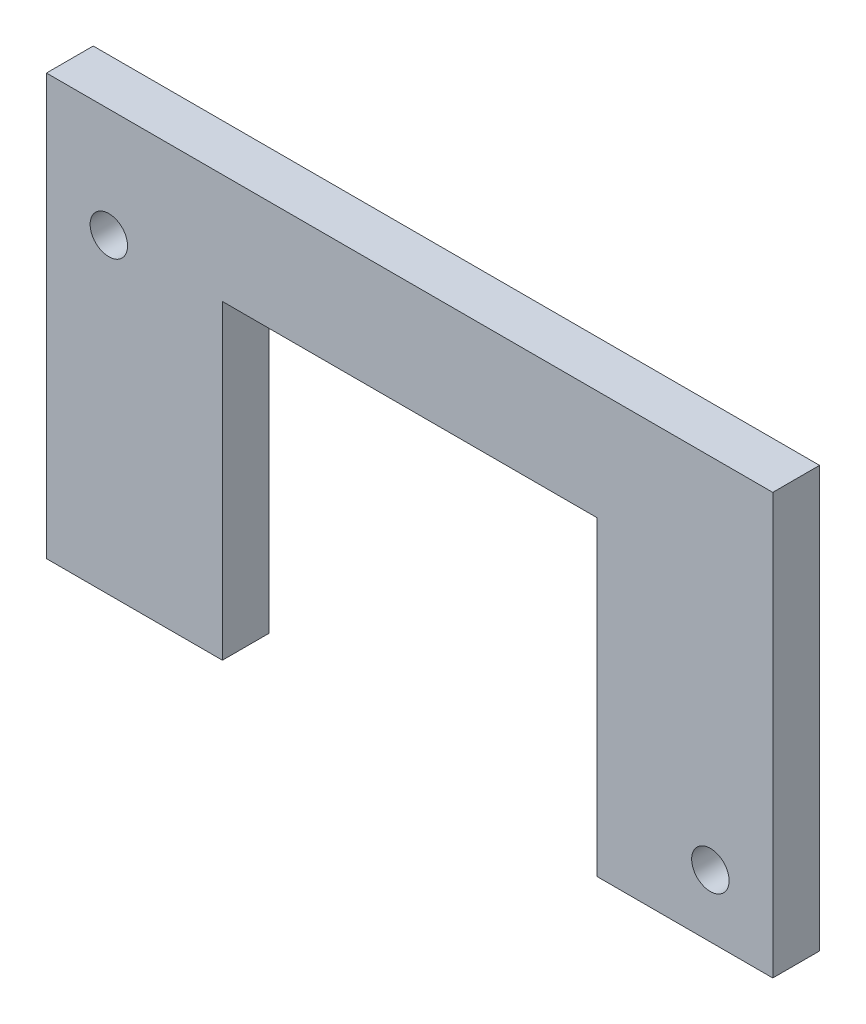
ISO-10303-21;
HEADER;
FILE_DESCRIPTION(('STEP AP214'),'2;1');
FILE_NAME('part.step','',(''),(''),'','','');
FILE_SCHEMA(('AUTOMOTIVE_DESIGN { 1 0 10303 214 1 1 1 1 }'));
ENDSEC;
DATA;
#1=APPLICATION_CONTEXT('core data for automotive mechanical design processes');
#2=APPLICATION_PROTOCOL_DEFINITION('international standard','automotive_design',2000,#1);
#3=PRODUCT_CONTEXT('',#1,'mechanical');
#4=PRODUCT('Part','Part','',(#3));
#5=PRODUCT_RELATED_PRODUCT_CATEGORY('part','',(#4));
#6=PRODUCT_DEFINITION_FORMATION('','',#4);
#7=PRODUCT_DEFINITION_CONTEXT('part definition',#1,'design');
#8=PRODUCT_DEFINITION('design','',#6,#7);
#9=PRODUCT_DEFINITION_SHAPE('','',#8);
#10=(LENGTH_UNIT() NAMED_UNIT(*) SI_UNIT(.MILLI.,.METRE.));
#11=(NAMED_UNIT(*) PLANE_ANGLE_UNIT() SI_UNIT($,.RADIAN.));
#12=(NAMED_UNIT(*) SI_UNIT($,.STERADIAN.) SOLID_ANGLE_UNIT());
#13=UNCERTAINTY_MEASURE_WITH_UNIT(LENGTH_MEASURE(1.E-05),#10,'distance_accuracy_value','');
#14=(GEOMETRIC_REPRESENTATION_CONTEXT(3) GLOBAL_UNCERTAINTY_ASSIGNED_CONTEXT((#13)) GLOBAL_UNIT_ASSIGNED_CONTEXT((#10,
#11,#12)) REPRESENTATION_CONTEXT('',''));
#15=CARTESIAN_POINT('',(0.,0.,0.));
#16=DIRECTION('',(0.,0.,1.));
#17=DIRECTION('',(1.,0.,0.));
#18=AXIS2_PLACEMENT_3D('',#15,#16,#17);
#19=CARTESIAN_POINT('',(-1.5875,-1.5875,2.38125));
#20=DIRECTION('',(0.,1.,0.));
#21=DIRECTION('',(0.,0.,1.));
#22=AXIS2_PLACEMENT_3D('',#19,#20,#21);
#23=PLANE('',#22);
#24=DIRECTION('',(1.,0.,0.));
#25=VECTOR('',#24,1.);
#26=CARTESIAN_POINT('',(-1.5875,-1.5875,0.));
#27=LINE('',#26,#25);
#28=CARTESIAN_POINT('',(-1.5875,-1.5875,0.));
#29=VERTEX_POINT('',#28);
#30=CARTESIAN_POINT('',(7.366,-1.5875,0.));
#31=VERTEX_POINT('',#30);
#32=EDGE_CURVE('E130',#29,#31,#27,.T.);
#33=ORIENTED_EDGE('',*,*,#32,.T.);
#34=DIRECTION('',(0.,0.,1.));
#35=VECTOR('',#34,1.);
#36=CARTESIAN_POINT('',(7.366,-1.5875,-0.00100000000000013));
#37=LINE('',#36,#35);
#38=CARTESIAN_POINT('',(7.366,-1.5875,2.38125));
#39=VERTEX_POINT('',#38);
#40=EDGE_CURVE('E113',#31,#39,#37,.T.);
#41=ORIENTED_EDGE('',*,*,#40,.T.);
#42=DIRECTION('',(1.,0.,0.));
#43=VECTOR('',#42,1.);
#44=CARTESIAN_POINT('',(-1.5875,-1.5875,2.38125));
#45=LINE('',#44,#43);
#46=CARTESIAN_POINT('',(-1.5875,-1.5875,2.38125));
#47=VERTEX_POINT('',#46);
#48=EDGE_CURVE('E91',#47,#39,#45,.T.);
#49=ORIENTED_EDGE('',*,*,#48,.F.);
#50=DIRECTION('',(0.,0.,-1.));
#51=VECTOR('',#50,1.);
#52=CARTESIAN_POINT('',(-1.5875,-1.5875,2.38125));
#53=LINE('',#52,#51);
#54=EDGE_CURVE('E11',#47,#29,#53,.T.);
#55=ORIENTED_EDGE('',*,*,#54,.T.);
#56=EDGE_LOOP('',(#33,#41,#49,#55));
#57=FACE_BOUND('',#56,.T.);
#58=ADVANCED_FACE('F38',(#57),#23,.F.);
#59=CARTESIAN_POINT('',(0.,0.,2.38125));
#60=DIRECTION('',(0.,0.,-1.));
#61=DIRECTION('',(-1.,0.,0.));
#62=AXIS2_PLACEMENT_3D('',#59,#60,#61);
#63=PLANE('',#62);
#64=ORIENTED_EDGE('',*,*,#48,.T.);
#65=DIRECTION('',(0.,-1.,0.));
#66=VECTOR('',#65,1.);
#67=CARTESIAN_POINT('',(7.366,-1.5875,2.38125));
#68=LINE('',#67,#66);
#69=CARTESIAN_POINT('',(7.366,14.224,2.38125));
#70=VERTEX_POINT('',#69);
#71=EDGE_CURVE('E119',#70,#39,#68,.T.);
#72=ORIENTED_EDGE('',*,*,#71,.F.);
#73=DIRECTION('',(-1.,0.,0.));
#74=VECTOR('',#73,1.);
#75=CARTESIAN_POINT('',(7.366,14.224,2.38125));
#76=LINE('',#75,#74);
#77=CARTESIAN_POINT('',(26.416,14.224,2.38125));
#78=VERTEX_POINT('',#77);
#79=EDGE_CURVE('E123',#78,#70,#76,.T.);
#80=ORIENTED_EDGE('',*,*,#79,.F.);
#81=DIRECTION('',(0.,1.,0.));
#82=VECTOR('',#81,1.);
#83=CARTESIAN_POINT('',(26.416,-1.5875,2.38125));
#84=LINE('',#83,#82);
#85=CARTESIAN_POINT('',(26.416,-1.5875,2.38125));
#86=VERTEX_POINT('',#85);
#87=EDGE_CURVE('E247',#86,#78,#84,.T.);
#88=ORIENTED_EDGE('',*,*,#87,.F.);
#89=CARTESIAN_POINT('',(35.3695,-1.5875,2.38125));
#90=VERTEX_POINT('',#89);
#91=EDGE_CURVE('E189',#86,#90,#45,.T.);
#92=ORIENTED_EDGE('',*,*,#91,.T.);
#93=DIRECTION('',(0.,1.,0.));
#94=VECTOR('',#93,1.);
#95=CARTESIAN_POINT('',(35.3695,-1.5875,2.38125));
#96=LINE('',#95,#94);
#97=CARTESIAN_POINT('',(35.3695,19.812,2.38125));
#98=VERTEX_POINT('',#97);
#99=EDGE_CURVE('E165',#90,#98,#96,.T.);
#100=ORIENTED_EDGE('',*,*,#99,.T.);
#101=DIRECTION('',(-1.,0.,0.));
#102=VECTOR('',#101,1.);
#103=CARTESIAN_POINT('',(-1.5875,19.812,2.38125));
#104=LINE('',#103,#102);
#105=CARTESIAN_POINT('',(-1.5875,19.812,2.38125));
#106=VERTEX_POINT('',#105);
#107=EDGE_CURVE('E63',#98,#106,#104,.T.);
#108=ORIENTED_EDGE('',*,*,#107,.T.);
#109=DIRECTION('',(0.,-1.,0.));
#110=VECTOR('',#109,1.);
#111=CARTESIAN_POINT('',(-1.5875,-1.5875,2.38125));
#112=LINE('',#111,#110);
#113=EDGE_CURVE('E151',#106,#47,#112,.T.);
#114=ORIENTED_EDGE('',*,*,#113,.T.);
#115=EDGE_LOOP('',(#64,#72,#80,#88,#92,#100,#108,#114));
#116=FACE_BOUND('',#115,.T.);
#117=CARTESIAN_POINT('',(1.5875,14.25575,2.38125));
#118=DIRECTION('',(0.,0.,1.));
#119=DIRECTION('',(1.,0.,0.));
#120=AXIS2_PLACEMENT_3D('',#117,#118,#119);
#121=CIRCLE('',#120,0.9525);
#122=CARTESIAN_POINT('',(2.54,14.25575,2.38125));
#123=VERTEX_POINT('',#122);
#124=EDGE_CURVE('E171',#123,#123,#121,.T.);
#125=ORIENTED_EDGE('',*,*,#124,.F.);
#126=EDGE_LOOP('',(#125));
#127=FACE_BOUND('',#126,.T.);
#128=CARTESIAN_POINT('',(32.1945,1.5875,2.38125));
#129=DIRECTION('',(0.,0.,1.));
#130=DIRECTION('',(1.,0.,0.));
#131=AXIS2_PLACEMENT_3D('',#128,#129,#130);
#132=CIRCLE('',#131,0.952500000000004);
#133=CARTESIAN_POINT('',(33.147,1.5875,2.38125));
#134=VERTEX_POINT('',#133);
#135=EDGE_CURVE('E181',#134,#134,#132,.T.);
#136=ORIENTED_EDGE('',*,*,#135,.F.);
#137=EDGE_LOOP('',(#136));
#138=FACE_BOUND('',#137,.T.);
#139=ADVANCED_FACE('F232',(#116,#127,#138),#63,.F.);
#140=CARTESIAN_POINT('',(0.,0.,0.));
#141=DIRECTION('',(0.,0.,-1.));
#142=DIRECTION('',(-1.,0.,0.));
#143=AXIS2_PLACEMENT_3D('',#140,#141,#142);
#144=PLANE('',#143);
#145=DIRECTION('',(0.,-1.,0.));
#146=VECTOR('',#145,1.);
#147=CARTESIAN_POINT('',(7.366,-1.5875,0.));
#148=LINE('',#147,#146);
#149=CARTESIAN_POINT('',(7.366,14.224,0.));
#150=VERTEX_POINT('',#149);
#151=EDGE_CURVE('E116',#150,#31,#148,.T.);
#152=ORIENTED_EDGE('',*,*,#151,.T.);
#153=ORIENTED_EDGE('',*,*,#32,.F.);
#154=DIRECTION('',(0.,-1.,0.));
#155=VECTOR('',#154,1.);
#156=CARTESIAN_POINT('',(-1.5875,-1.5875,0.));
#157=LINE('',#156,#155);
#158=CARTESIAN_POINT('',(-1.5875,19.812,0.));
#159=VERTEX_POINT('',#158);
#160=EDGE_CURVE('E145',#159,#29,#157,.T.);
#161=ORIENTED_EDGE('',*,*,#160,.F.);
#162=DIRECTION('',(-1.,0.,0.));
#163=VECTOR('',#162,1.);
#164=CARTESIAN_POINT('',(-1.5875,19.812,0.));
#165=LINE('',#164,#163);
#166=CARTESIAN_POINT('',(35.3695,19.812,0.));
#167=VERTEX_POINT('',#166);
#168=EDGE_CURVE('E84',#167,#159,#165,.T.);
#169=ORIENTED_EDGE('',*,*,#168,.F.);
#170=DIRECTION('',(0.,1.,0.));
#171=VECTOR('',#170,1.);
#172=CARTESIAN_POINT('',(35.3695,-1.5875,0.));
#173=LINE('',#172,#171);
#174=CARTESIAN_POINT('',(35.3695,-1.5875,0.));
#175=VERTEX_POINT('',#174);
#176=EDGE_CURVE('E137',#175,#167,#173,.T.);
#177=ORIENTED_EDGE('',*,*,#176,.F.);
#178=CARTESIAN_POINT('',(26.416,-1.5875,0.));
#179=VERTEX_POINT('',#178);
#180=EDGE_CURVE('E138',#179,#175,#27,.T.);
#181=ORIENTED_EDGE('',*,*,#180,.F.);
#182=DIRECTION('',(0.,1.,0.));
#183=VECTOR('',#182,1.);
#184=CARTESIAN_POINT('',(26.416,-1.5875,0.));
#185=LINE('',#184,#183);
#186=CARTESIAN_POINT('',(26.416,14.224,0.));
#187=VERTEX_POINT('',#186);
#188=EDGE_CURVE('E54',#179,#187,#185,.T.);
#189=ORIENTED_EDGE('',*,*,#188,.T.);
#190=DIRECTION('',(-1.,0.,0.));
#191=VECTOR('',#190,1.);
#192=CARTESIAN_POINT('',(7.366,14.224,0.));
#193=LINE('',#192,#191);
#194=EDGE_CURVE('E131',#187,#150,#193,.T.);
#195=ORIENTED_EDGE('',*,*,#194,.T.);
#196=EDGE_LOOP('',(#152,#153,#161,#169,#177,#181,#189,#195));
#197=FACE_BOUND('',#196,.T.);
#198=CARTESIAN_POINT('',(1.5875,14.25575,0.));
#199=DIRECTION('',(0.,0.,1.));
#200=DIRECTION('',(1.,0.,0.));
#201=AXIS2_PLACEMENT_3D('',#198,#199,#200);
#202=CIRCLE('',#201,0.9525);
#203=CARTESIAN_POINT('',(2.54,14.25575,0.));
#204=VERTEX_POINT('',#203);
#205=EDGE_CURVE('E174',#204,#204,#202,.T.);
#206=ORIENTED_EDGE('',*,*,#205,.T.);
#207=EDGE_LOOP('',(#206));
#208=FACE_BOUND('',#207,.T.);
#209=CARTESIAN_POINT('',(32.1945,1.5875,0.));
#210=DIRECTION('',(0.,0.,1.));
#211=DIRECTION('',(1.,0.,0.));
#212=AXIS2_PLACEMENT_3D('',#209,#210,#211);
#213=CIRCLE('',#212,0.952500000000004);
#214=CARTESIAN_POINT('',(33.147,1.5875,0.));
#215=VERTEX_POINT('',#214);
#216=EDGE_CURVE('E184',#215,#215,#213,.T.);
#217=ORIENTED_EDGE('',*,*,#216,.T.);
#218=EDGE_LOOP('',(#217));
#219=FACE_BOUND('',#218,.T.);
#220=ADVANCED_FACE('F127',(#197,#208,#219),#144,.T.);
#221=CARTESIAN_POINT('',(-1.5875,-1.5875,2.38125));
#222=DIRECTION('',(1.,0.,0.));
#223=DIRECTION('',(0.,0.,-1.));
#224=AXIS2_PLACEMENT_3D('',#221,#222,#223);
#225=PLANE('',#224);
#226=ORIENTED_EDGE('',*,*,#160,.T.);
#227=ORIENTED_EDGE('',*,*,#54,.F.);
#228=ORIENTED_EDGE('',*,*,#113,.F.);
#229=DIRECTION('',(0.,0.,-1.));
#230=VECTOR('',#229,1.);
#231=CARTESIAN_POINT('',(-1.5875,19.812,2.38125));
#232=LINE('',#231,#230);
#233=EDGE_CURVE('E152',#106,#159,#232,.T.);
#234=ORIENTED_EDGE('',*,*,#233,.T.);
#235=EDGE_LOOP('',(#226,#227,#228,#234));
#236=FACE_BOUND('',#235,.T.);
#237=ADVANCED_FACE('F40',(#236),#225,.F.);
#238=ORIENTED_EDGE('',*,*,#91,.F.);
#239=DIRECTION('',(0.,0.,1.));
#240=VECTOR('',#239,1.);
#241=CARTESIAN_POINT('',(26.416,-1.5875,-0.00100000000000013));
#242=LINE('',#241,#240);
#243=EDGE_CURVE('E122',#179,#86,#242,.T.);
#244=ORIENTED_EDGE('',*,*,#243,.F.);
#245=ORIENTED_EDGE('',*,*,#180,.T.);
#246=DIRECTION('',(0.,0.,-1.));
#247=VECTOR('',#246,1.);
#248=CARTESIAN_POINT('',(35.3695,-1.5875,2.38125));
#249=LINE('',#248,#247);
#250=EDGE_CURVE('E47',#90,#175,#249,.T.);
#251=ORIENTED_EDGE('',*,*,#250,.F.);
#252=EDGE_LOOP('',(#238,#244,#245,#251));
#253=FACE_BOUND('',#252,.T.);
#254=ADVANCED_FACE('F233',(#253),#23,.F.);
#255=CARTESIAN_POINT('',(35.3695,-1.5875,2.38125));
#256=DIRECTION('',(-1.,0.,0.));
#257=DIRECTION('',(0.,0.,1.));
#258=AXIS2_PLACEMENT_3D('',#255,#256,#257);
#259=PLANE('',#258);
#260=ORIENTED_EDGE('',*,*,#176,.T.);
#261=DIRECTION('',(0.,0.,-1.));
#262=VECTOR('',#261,1.);
#263=CARTESIAN_POINT('',(35.3695,19.812,2.38125));
#264=LINE('',#263,#262);
#265=EDGE_CURVE('E155',#98,#167,#264,.T.);
#266=ORIENTED_EDGE('',*,*,#265,.F.);
#267=ORIENTED_EDGE('',*,*,#99,.F.);
#268=ORIENTED_EDGE('',*,*,#250,.T.);
#269=EDGE_LOOP('',(#260,#266,#267,#268));
#270=FACE_BOUND('',#269,.T.);
#271=ADVANCED_FACE('F163',(#270),#259,.F.);
#272=CARTESIAN_POINT('',(-1.5875,19.812,2.38125));
#273=DIRECTION('',(0.,-1.,0.));
#274=DIRECTION('',(0.,0.,-1.));
#275=AXIS2_PLACEMENT_3D('',#272,#273,#274);
#276=PLANE('',#275);
#277=ORIENTED_EDGE('',*,*,#168,.T.);
#278=ORIENTED_EDGE('',*,*,#233,.F.);
#279=ORIENTED_EDGE('',*,*,#107,.F.);
#280=ORIENTED_EDGE('',*,*,#265,.T.);
#281=EDGE_LOOP('',(#277,#278,#279,#280));
#282=FACE_BOUND('',#281,.T.);
#283=ADVANCED_FACE('F229',(#282),#276,.F.);
#284=CARTESIAN_POINT('',(1.5875,14.25575,2.38125));
#285=DIRECTION('',(0.,0.,-1.));
#286=DIRECTION('',(-1.,0.,0.));
#287=AXIS2_PLACEMENT_3D('',#284,#285,#286);
#288=CYLINDRICAL_SURFACE('',#287,0.9525);
#289=ORIENTED_EDGE('',*,*,#124,.T.);
#290=EDGE_LOOP('',(#289));
#291=FACE_BOUND('',#290,.T.);
#292=ORIENTED_EDGE('',*,*,#205,.F.);
#293=EDGE_LOOP('',(#292));
#294=FACE_BOUND('',#293,.T.);
#295=ADVANCED_FACE('F221',(#291,#294),#288,.F.);
#296=CARTESIAN_POINT('',(32.1945,1.5875,2.38125));
#297=DIRECTION('',(0.,0.,-1.));
#298=DIRECTION('',(-1.,0.,0.));
#299=AXIS2_PLACEMENT_3D('',#296,#297,#298);
#300=CYLINDRICAL_SURFACE('',#299,0.952500000000004);
#301=ORIENTED_EDGE('',*,*,#135,.T.);
#302=EDGE_LOOP('',(#301));
#303=FACE_BOUND('',#302,.T.);
#304=ORIENTED_EDGE('',*,*,#216,.F.);
#305=EDGE_LOOP('',(#304));
#306=FACE_BOUND('',#305,.T.);
#307=ADVANCED_FACE('F219',(#303,#306),#300,.F.);
#308=CARTESIAN_POINT('',(7.366,-1.5875,-0.00100000000000013));
#309=DIRECTION('',(-1.,0.,0.));
#310=DIRECTION('',(0.,-1.,0.));
#311=AXIS2_PLACEMENT_3D('',#308,#309,#310);
#312=PLANE('',#311);
#313=DIRECTION('',(0.,0.,1.));
#314=VECTOR('',#313,1.);
#315=CARTESIAN_POINT('',(7.366,14.224,-0.00100000000000013));
#316=LINE('',#315,#314);
#317=EDGE_CURVE('E197',#150,#70,#316,.T.);
#318=ORIENTED_EDGE('',*,*,#317,.T.);
#319=ORIENTED_EDGE('',*,*,#71,.T.);
#320=ORIENTED_EDGE('',*,*,#40,.F.);
#321=ORIENTED_EDGE('',*,*,#151,.F.);
#322=EDGE_LOOP('',(#318,#319,#320,#321));
#323=FACE_BOUND('',#322,.T.);
#324=ADVANCED_FACE('F115',(#323),#312,.F.);
#325=CARTESIAN_POINT('',(7.366,14.224,-0.00100000000000013));
#326=DIRECTION('',(0.,1.,0.));
#327=DIRECTION('',(0.,0.,1.));
#328=AXIS2_PLACEMENT_3D('',#325,#326,#327);
#329=PLANE('',#328);
#330=DIRECTION('',(0.,0.,1.));
#331=VECTOR('',#330,1.);
#332=CARTESIAN_POINT('',(26.416,14.224,-0.00100000000000013));
#333=LINE('',#332,#331);
#334=EDGE_CURVE('E198',#187,#78,#333,.T.);
#335=ORIENTED_EDGE('',*,*,#334,.T.);
#336=ORIENTED_EDGE('',*,*,#79,.T.);
#337=ORIENTED_EDGE('',*,*,#317,.F.);
#338=ORIENTED_EDGE('',*,*,#194,.F.);
#339=EDGE_LOOP('',(#335,#336,#337,#338));
#340=FACE_BOUND('',#339,.T.);
#341=ADVANCED_FACE('F227',(#340),#329,.F.);
#342=CARTESIAN_POINT('',(26.416,-1.5875,-0.00100000000000013));
#343=DIRECTION('',(1.,0.,0.));
#344=DIRECTION('',(0.,1.,0.));
#345=AXIS2_PLACEMENT_3D('',#342,#343,#344);
#346=PLANE('',#345);
#347=ORIENTED_EDGE('',*,*,#243,.T.);
#348=ORIENTED_EDGE('',*,*,#87,.T.);
#349=ORIENTED_EDGE('',*,*,#334,.F.);
#350=ORIENTED_EDGE('',*,*,#188,.F.);
#351=EDGE_LOOP('',(#347,#348,#349,#350));
#352=FACE_BOUND('',#351,.T.);
#353=ADVANCED_FACE('F297',(#352),#346,.F.);
#354=CLOSED_SHELL('',(#58,#139,#220,#237,#254,#271,#283,#295,#307,#324,#341,#353));
#355=MANIFOLD_SOLID_BREP('B2',#354);
#356=ADVANCED_BREP_SHAPE_REPRESENTATION('',(#18,#355),#14);
#357=SHAPE_DEFINITION_REPRESENTATION(#9,#356);
ENDSEC;
END-ISO-10303-21;
